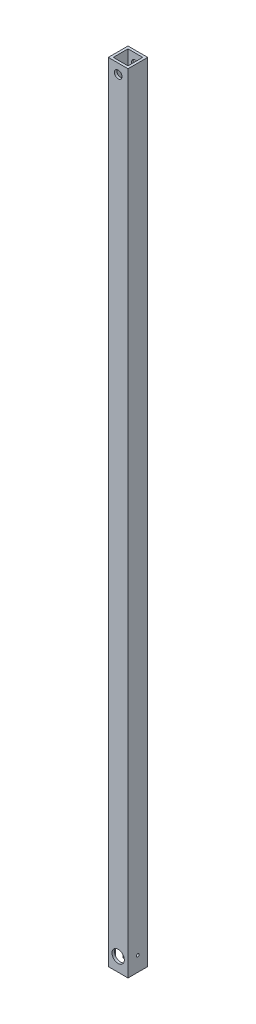
ISO-10303-21;
HEADER;
FILE_DESCRIPTION(('STEP AP214'),'2;1');
FILE_NAME('part.step','',(''),(''),'','','');
FILE_SCHEMA(('AUTOMOTIVE_DESIGN { 1 0 10303 214 1 1 1 1 }'));
ENDSEC;
DATA;
#1=APPLICATION_CONTEXT('core data for automotive mechanical design processes');
#2=APPLICATION_PROTOCOL_DEFINITION('international standard','automotive_design',2000,#1);
#3=PRODUCT_CONTEXT('',#1,'mechanical');
#4=PRODUCT('Part','Part','',(#3));
#5=PRODUCT_RELATED_PRODUCT_CATEGORY('part','',(#4));
#6=PRODUCT_DEFINITION_FORMATION('','',#4);
#7=PRODUCT_DEFINITION_CONTEXT('part definition',#1,'design');
#8=PRODUCT_DEFINITION('design','',#6,#7);
#9=PRODUCT_DEFINITION_SHAPE('','',#8);
#10=(LENGTH_UNIT() NAMED_UNIT(*) SI_UNIT(.MILLI.,.METRE.));
#11=(NAMED_UNIT(*) PLANE_ANGLE_UNIT() SI_UNIT($,.RADIAN.));
#12=(NAMED_UNIT(*) SI_UNIT($,.STERADIAN.) SOLID_ANGLE_UNIT());
#13=UNCERTAINTY_MEASURE_WITH_UNIT(LENGTH_MEASURE(1.E-05),#10,'distance_accuracy_value','');
#14=(GEOMETRIC_REPRESENTATION_CONTEXT(3) GLOBAL_UNCERTAINTY_ASSIGNED_CONTEXT((#13)) GLOBAL_UNIT_ASSIGNED_CONTEXT((#10,
#11,#12)) REPRESENTATION_CONTEXT('',''));
#15=CARTESIAN_POINT('',(0.,0.,0.));
#16=DIRECTION('',(0.,0.,1.));
#17=DIRECTION('',(1.,0.,0.));
#18=AXIS2_PLACEMENT_3D('',#15,#16,#17);
#19=CARTESIAN_POINT('',(0.,508.,0.));
#20=DIRECTION('',(0.,1.,0.));
#21=DIRECTION('',(0.,0.,1.));
#22=AXIS2_PLACEMENT_3D('',#19,#20,#21);
#23=PLANE('',#22);
#24=DIRECTION('',(0.,0.,-1.));
#25=VECTOR('',#24,1.);
#26=CARTESIAN_POINT('',(6.35,508.,-6.35));
#27=LINE('',#26,#25);
#28=CARTESIAN_POINT('',(6.35,508.,6.35));
#29=VERTEX_POINT('',#28);
#30=CARTESIAN_POINT('',(6.35,508.,-6.35));
#31=VERTEX_POINT('',#30);
#32=EDGE_CURVE('E237',#29,#31,#27,.T.);
#33=ORIENTED_EDGE('',*,*,#32,.T.);
#34=DIRECTION('',(-1.,0.,0.));
#35=VECTOR('',#34,1.);
#36=CARTESIAN_POINT('',(-6.35,508.,-6.35));
#37=LINE('',#36,#35);
#38=CARTESIAN_POINT('',(-6.35,508.,-6.35));
#39=VERTEX_POINT('',#38);
#40=EDGE_CURVE('E240',#31,#39,#37,.T.);
#41=ORIENTED_EDGE('',*,*,#40,.T.);
#42=DIRECTION('',(0.,0.,1.));
#43=VECTOR('',#42,1.);
#44=CARTESIAN_POINT('',(-6.35,508.,-6.35));
#45=LINE('',#44,#43);
#46=CARTESIAN_POINT('',(-6.35,508.,6.35));
#47=VERTEX_POINT('',#46);
#48=EDGE_CURVE('E243',#39,#47,#45,.T.);
#49=ORIENTED_EDGE('',*,*,#48,.T.);
#50=DIRECTION('',(1.,0.,0.));
#51=VECTOR('',#50,1.);
#52=CARTESIAN_POINT('',(-6.35,508.,6.35));
#53=LINE('',#52,#51);
#54=EDGE_CURVE('E245',#47,#29,#53,.T.);
#55=ORIENTED_EDGE('',*,*,#54,.T.);
#56=EDGE_LOOP('',(#33,#41,#49,#55));
#57=FACE_BOUND('',#56,.T.);
#58=DIRECTION('',(-1.,0.,0.));
#59=VECTOR('',#58,1.);
#60=CARTESIAN_POINT('',(-6.35,508.,-4.7625));
#61=LINE('',#60,#59);
#62=CARTESIAN_POINT('',(4.7625,508.,-4.7625));
#63=VERTEX_POINT('',#62);
#64=CARTESIAN_POINT('',(-4.7625,508.,-4.7625));
#65=VERTEX_POINT('',#64);
#66=EDGE_CURVE('E210',#63,#65,#61,.T.);
#67=ORIENTED_EDGE('',*,*,#66,.F.);
#68=DIRECTION('',(0.,0.,-1.));
#69=VECTOR('',#68,1.);
#70=CARTESIAN_POINT('',(4.7625,508.,-6.35));
#71=LINE('',#70,#69);
#72=CARTESIAN_POINT('',(4.7625,508.,4.7625));
#73=VERTEX_POINT('',#72);
#74=EDGE_CURVE('E208',#73,#63,#71,.T.);
#75=ORIENTED_EDGE('',*,*,#74,.F.);
#76=DIRECTION('',(1.,0.,0.));
#77=VECTOR('',#76,1.);
#78=CARTESIAN_POINT('',(-6.35,508.,4.7625));
#79=LINE('',#78,#77);
#80=CARTESIAN_POINT('',(-4.7625,508.,4.7625));
#81=VERTEX_POINT('',#80);
#82=EDGE_CURVE('E215',#81,#73,#79,.T.);
#83=ORIENTED_EDGE('',*,*,#82,.F.);
#84=DIRECTION('',(0.,0.,1.));
#85=VECTOR('',#84,1.);
#86=CARTESIAN_POINT('',(-4.7625,508.,-6.35));
#87=LINE('',#86,#85);
#88=EDGE_CURVE('E213',#65,#81,#87,.T.);
#89=ORIENTED_EDGE('',*,*,#88,.F.);
#90=EDGE_LOOP('',(#67,#75,#83,#89));
#91=FACE_BOUND('',#90,.T.);
#92=ADVANCED_FACE('F61',(#57,#91),#23,.T.);
#93=CARTESIAN_POINT('',(0.,0.,0.));
#94=DIRECTION('',(0.,1.,0.));
#95=DIRECTION('',(0.,0.,1.));
#96=AXIS2_PLACEMENT_3D('',#93,#94,#95);
#97=PLANE('',#96);
#98=DIRECTION('',(0.,0.,1.));
#99=VECTOR('',#98,1.);
#100=CARTESIAN_POINT('',(-6.35,0.,-6.35));
#101=LINE('',#100,#99);
#102=CARTESIAN_POINT('',(-6.35,0.,3.175));
#103=VERTEX_POINT('',#102);
#104=CARTESIAN_POINT('',(-6.35,0.,6.35));
#105=VERTEX_POINT('',#104);
#106=EDGE_CURVE('E252',#103,#105,#101,.T.);
#107=ORIENTED_EDGE('',*,*,#106,.F.);
#108=DIRECTION('',(-1.,0.,0.));
#109=VECTOR('',#108,1.);
#110=CARTESIAN_POINT('',(6.351,0.,3.175));
#111=LINE('',#110,#109);
#112=CARTESIAN_POINT('',(-4.7625,0.,3.175));
#113=VERTEX_POINT('',#112);
#114=EDGE_CURVE('E170',#113,#103,#111,.T.);
#115=ORIENTED_EDGE('',*,*,#114,.F.);
#116=DIRECTION('',(0.,0.,1.));
#117=VECTOR('',#116,1.);
#118=CARTESIAN_POINT('',(-4.7625,0.,-6.35));
#119=LINE('',#118,#117);
#120=CARTESIAN_POINT('',(-4.7625,0.,4.7625));
#121=VERTEX_POINT('',#120);
#122=EDGE_CURVE('E174',#113,#121,#119,.T.);
#123=ORIENTED_EDGE('',*,*,#122,.T.);
#124=DIRECTION('',(1.,0.,0.));
#125=VECTOR('',#124,1.);
#126=CARTESIAN_POINT('',(-6.35,0.,4.7625));
#127=LINE('',#126,#125);
#128=CARTESIAN_POINT('',(4.7625,0.,4.7625));
#129=VERTEX_POINT('',#128);
#130=EDGE_CURVE('E211',#121,#129,#127,.T.);
#131=ORIENTED_EDGE('',*,*,#130,.T.);
#132=DIRECTION('',(0.,0.,-1.));
#133=VECTOR('',#132,1.);
#134=CARTESIAN_POINT('',(4.7625,0.,-6.35));
#135=LINE('',#134,#133);
#136=CARTESIAN_POINT('',(4.7625,0.,-4.7625));
#137=VERTEX_POINT('',#136);
#138=EDGE_CURVE('E207',#129,#137,#135,.T.);
#139=ORIENTED_EDGE('',*,*,#138,.T.);
#140=DIRECTION('',(-1.,0.,0.));
#141=VECTOR('',#140,1.);
#142=CARTESIAN_POINT('',(-6.35,0.,-4.7625));
#143=LINE('',#142,#141);
#144=CARTESIAN_POINT('',(-4.7625,0.,-4.7625));
#145=VERTEX_POINT('',#144);
#146=EDGE_CURVE('E220',#137,#145,#143,.T.);
#147=ORIENTED_EDGE('',*,*,#146,.T.);
#148=CARTESIAN_POINT('',(-4.7625,0.,-3.175));
#149=VERTEX_POINT('',#148);
#150=EDGE_CURVE('E223',#145,#149,#119,.T.);
#151=ORIENTED_EDGE('',*,*,#150,.T.);
#152=DIRECTION('',(-1.,0.,0.));
#153=VECTOR('',#152,1.);
#154=CARTESIAN_POINT('',(6.351,0.,-3.175));
#155=LINE('',#154,#153);
#156=CARTESIAN_POINT('',(-6.35,0.,-3.175));
#157=VERTEX_POINT('',#156);
#158=EDGE_CURVE('E77',#149,#157,#155,.T.);
#159=ORIENTED_EDGE('',*,*,#158,.T.);
#160=CARTESIAN_POINT('',(-6.35,0.,-6.35));
#161=VERTEX_POINT('',#160);
#162=EDGE_CURVE('E253',#161,#157,#101,.T.);
#163=ORIENTED_EDGE('',*,*,#162,.F.);
#164=DIRECTION('',(-1.,0.,0.));
#165=VECTOR('',#164,1.);
#166=CARTESIAN_POINT('',(-6.35,0.,-6.35));
#167=LINE('',#166,#165);
#168=CARTESIAN_POINT('',(6.35,0.,-6.35));
#169=VERTEX_POINT('',#168);
#170=EDGE_CURVE('E250',#169,#161,#167,.T.);
#171=ORIENTED_EDGE('',*,*,#170,.F.);
#172=DIRECTION('',(0.,0.,-1.));
#173=VECTOR('',#172,1.);
#174=CARTESIAN_POINT('',(6.35,0.,-6.35));
#175=LINE('',#174,#173);
#176=CARTESIAN_POINT('',(6.35,0.,6.35));
#177=VERTEX_POINT('',#176);
#178=EDGE_CURVE('E236',#177,#169,#175,.T.);
#179=ORIENTED_EDGE('',*,*,#178,.F.);
#180=DIRECTION('',(1.,0.,0.));
#181=VECTOR('',#180,1.);
#182=CARTESIAN_POINT('',(-6.35,0.,6.35));
#183=LINE('',#182,#181);
#184=EDGE_CURVE('E241',#105,#177,#183,.T.);
#185=ORIENTED_EDGE('',*,*,#184,.F.);
#186=EDGE_LOOP('',(#107,#115,#123,#131,#139,#147,#151,#159,#163,#171,#179,#185));
#187=FACE_BOUND('',#186,.T.);
#188=ADVANCED_FACE('F273',(#187),#97,.F.);
#189=CARTESIAN_POINT('',(6.35,508.,-6.35));
#190=DIRECTION('',(-1.,0.,0.));
#191=DIRECTION('',(0.,0.,1.));
#192=AXIS2_PLACEMENT_3D('',#189,#190,#191);
#193=PLANE('',#192);
#194=CARTESIAN_POINT('',(6.35,9.525,0.));
#195=DIRECTION('',(1.,0.,0.));
#196=DIRECTION('',(0.,0.,-1.));
#197=AXIS2_PLACEMENT_3D('',#194,#195,#196);
#198=CIRCLE('',#197,0.889);
#199=CARTESIAN_POINT('',(6.35,9.525,-0.889));
#200=VERTEX_POINT('',#199);
#201=EDGE_CURVE('E189',#200,#200,#198,.T.);
#202=ORIENTED_EDGE('',*,*,#201,.F.);
#203=EDGE_LOOP('',(#202));
#204=FACE_BOUND('',#203,.T.);
#205=ORIENTED_EDGE('',*,*,#178,.T.);
#206=DIRECTION('',(0.,-1.,0.));
#207=VECTOR('',#206,1.);
#208=CARTESIAN_POINT('',(6.35,508.,-6.35));
#209=LINE('',#208,#207);
#210=EDGE_CURVE('E12',#31,#169,#209,.T.);
#211=ORIENTED_EDGE('',*,*,#210,.F.);
#212=ORIENTED_EDGE('',*,*,#32,.F.);
#213=DIRECTION('',(0.,-1.,0.));
#214=VECTOR('',#213,1.);
#215=CARTESIAN_POINT('',(6.35,508.,6.35));
#216=LINE('',#215,#214);
#217=EDGE_CURVE('E247',#29,#177,#216,.T.);
#218=ORIENTED_EDGE('',*,*,#217,.T.);
#219=EDGE_LOOP('',(#205,#211,#212,#218));
#220=FACE_BOUND('',#219,.T.);
#221=ADVANCED_FACE('F63',(#204,#220),#193,.F.);
#222=CARTESIAN_POINT('',(-6.35,508.,-6.35));
#223=DIRECTION('',(0.,0.,1.));
#224=DIRECTION('',(1.,0.,0.));
#225=AXIS2_PLACEMENT_3D('',#222,#223,#224);
#226=PLANE('',#225);
#227=CARTESIAN_POINT('',(0.,501.65,-6.35));
#228=DIRECTION('',(0.,0.,1.));
#229=DIRECTION('',(1.,0.,0.));
#230=AXIS2_PLACEMENT_3D('',#227,#228,#229);
#231=CIRCLE('',#230,2.47649999999998);
#232=CARTESIAN_POINT('',(2.47649999999998,501.65,-6.35));
#233=VERTEX_POINT('',#232);
#234=EDGE_CURVE('E192',#233,#233,#231,.T.);
#235=ORIENTED_EDGE('',*,*,#234,.T.);
#236=EDGE_LOOP('',(#235));
#237=FACE_BOUND('',#236,.T.);
#238=ORIENTED_EDGE('',*,*,#170,.T.);
#239=DIRECTION('',(0.,-1.,0.));
#240=VECTOR('',#239,1.);
#241=CARTESIAN_POINT('',(-6.35,508.,-6.35));
#242=LINE('',#241,#240);
#243=EDGE_CURVE('E70',#39,#161,#242,.T.);
#244=ORIENTED_EDGE('',*,*,#243,.F.);
#245=ORIENTED_EDGE('',*,*,#40,.F.);
#246=ORIENTED_EDGE('',*,*,#210,.T.);
#247=EDGE_LOOP('',(#238,#244,#245,#246));
#248=FACE_BOUND('',#247,.T.);
#249=ADVANCED_FACE('F289',(#237,#248),#226,.F.);
#250=CARTESIAN_POINT('',(-6.35,508.,-6.35));
#251=DIRECTION('',(1.,0.,0.));
#252=DIRECTION('',(0.,0.,-1.));
#253=AXIS2_PLACEMENT_3D('',#250,#251,#252);
#254=PLANE('',#253);
#255=DIRECTION('',(0.,0.,-1.));
#256=VECTOR('',#255,1.);
#257=CARTESIAN_POINT('',(-6.35,9.525,-3.175));
#258=LINE('',#257,#256);
#259=CARTESIAN_POINT('',(-6.35,9.525,3.175));
#260=VERTEX_POINT('',#259);
#261=CARTESIAN_POINT('',(-6.35,9.525,-3.175));
#262=VERTEX_POINT('',#261);
#263=EDGE_CURVE('E181',#260,#262,#258,.T.);
#264=ORIENTED_EDGE('',*,*,#263,.F.);
#265=DIRECTION('',(0.,1.,0.));
#266=VECTOR('',#265,1.);
#267=CARTESIAN_POINT('',(-6.35,0.,3.175));
#268=LINE('',#267,#266);
#269=EDGE_CURVE('E168',#103,#260,#268,.T.);
#270=ORIENTED_EDGE('',*,*,#269,.F.);
#271=ORIENTED_EDGE('',*,*,#106,.T.);
#272=DIRECTION('',(0.,-1.,0.));
#273=VECTOR('',#272,1.);
#274=CARTESIAN_POINT('',(-6.35,508.,6.35));
#275=LINE('',#274,#273);
#276=EDGE_CURVE('E259',#47,#105,#275,.T.);
#277=ORIENTED_EDGE('',*,*,#276,.F.);
#278=ORIENTED_EDGE('',*,*,#48,.F.);
#279=ORIENTED_EDGE('',*,*,#243,.T.);
#280=ORIENTED_EDGE('',*,*,#162,.T.);
#281=DIRECTION('',(0.,-1.,0.));
#282=VECTOR('',#281,1.);
#283=CARTESIAN_POINT('',(-6.35,0.,-3.175));
#284=LINE('',#283,#282);
#285=EDGE_CURVE('E178',#262,#157,#284,.T.);
#286=ORIENTED_EDGE('',*,*,#285,.F.);
#287=EDGE_LOOP('',(#264,#270,#271,#277,#278,#279,#280,#286));
#288=FACE_BOUND('',#287,.T.);
#289=ADVANCED_FACE('F267',(#288),#254,.F.);
#290=CARTESIAN_POINT('',(-6.35,508.,6.35));
#291=DIRECTION('',(0.,0.,-1.));
#292=DIRECTION('',(-1.,0.,0.));
#293=AXIS2_PLACEMENT_3D('',#290,#291,#292);
#294=PLANE('',#293);
#295=CARTESIAN_POINT('',(0.,501.65,6.35));
#296=DIRECTION('',(0.,0.,-1.));
#297=DIRECTION('',(-1.,0.,0.));
#298=AXIS2_PLACEMENT_3D('',#295,#296,#297);
#299=CIRCLE('',#298,2.47649999999998);
#300=CARTESIAN_POINT('',(-2.47649999999998,501.65,6.35));
#301=VERTEX_POINT('',#300);
#302=EDGE_CURVE('E198',#301,#301,#299,.T.);
#303=ORIENTED_EDGE('',*,*,#302,.T.);
#304=EDGE_LOOP('',(#303));
#305=FACE_BOUND('',#304,.T.);
#306=CARTESIAN_POINT('',(0.,8.91230119999997,6.35));
#307=DIRECTION('',(0.,0.,1.));
#308=DIRECTION('',(1.,0.,0.));
#309=AXIS2_PLACEMENT_3D('',#306,#307,#308);
#310=CIRCLE('',#309,3.96875000000002);
#311=CARTESIAN_POINT('',(3.96875000000003,8.91230119999997,6.35));
#312=VERTEX_POINT('',#311);
#313=EDGE_CURVE('E201',#312,#312,#310,.T.);
#314=ORIENTED_EDGE('',*,*,#313,.F.);
#315=EDGE_LOOP('',(#314));
#316=FACE_BOUND('',#315,.T.);
#317=ORIENTED_EDGE('',*,*,#184,.T.);
#318=ORIENTED_EDGE('',*,*,#217,.F.);
#319=ORIENTED_EDGE('',*,*,#54,.F.);
#320=ORIENTED_EDGE('',*,*,#276,.T.);
#321=EDGE_LOOP('',(#317,#318,#319,#320));
#322=FACE_BOUND('',#321,.T.);
#323=ADVANCED_FACE('F282',(#305,#316,#322),#294,.F.);
#324=CARTESIAN_POINT('',(4.7625,508.,-6.35));
#325=DIRECTION('',(-1.,0.,0.));
#326=DIRECTION('',(0.,0.,1.));
#327=AXIS2_PLACEMENT_3D('',#324,#325,#326);
#328=PLANE('',#327);
#329=CARTESIAN_POINT('',(4.7625,9.525,0.));
#330=DIRECTION('',(-1.,0.,0.));
#331=DIRECTION('',(0.,0.,1.));
#332=AXIS2_PLACEMENT_3D('',#329,#330,#331);
#333=CIRCLE('',#332,0.889);
#334=CARTESIAN_POINT('',(4.7625,9.525,0.888999999999999));
#335=VERTEX_POINT('',#334);
#336=EDGE_CURVE('E183',#335,#335,#333,.F.);
#337=ORIENTED_EDGE('',*,*,#336,.T.);
#338=EDGE_LOOP('',(#337));
#339=FACE_BOUND('',#338,.T.);
#340=ORIENTED_EDGE('',*,*,#138,.F.);
#341=DIRECTION('',(0.,-1.,0.));
#342=VECTOR('',#341,1.);
#343=CARTESIAN_POINT('',(4.7625,508.,4.7625));
#344=LINE('',#343,#342);
#345=EDGE_CURVE('E217',#73,#129,#344,.T.);
#346=ORIENTED_EDGE('',*,*,#345,.F.);
#347=ORIENTED_EDGE('',*,*,#74,.T.);
#348=DIRECTION('',(0.,-1.,0.));
#349=VECTOR('',#348,1.);
#350=CARTESIAN_POINT('',(4.7625,508.,-4.7625));
#351=LINE('',#350,#349);
#352=EDGE_CURVE('E233',#63,#137,#351,.T.);
#353=ORIENTED_EDGE('',*,*,#352,.T.);
#354=EDGE_LOOP('',(#340,#346,#347,#353));
#355=FACE_BOUND('',#354,.T.);
#356=ADVANCED_FACE('F308',(#339,#355),#328,.T.);
#357=CARTESIAN_POINT('',(-6.35,508.,-4.7625));
#358=DIRECTION('',(0.,0.,1.));
#359=DIRECTION('',(1.,0.,0.));
#360=AXIS2_PLACEMENT_3D('',#357,#358,#359);
#361=PLANE('',#360);
#362=CARTESIAN_POINT('',(0.,501.65,-4.7625));
#363=DIRECTION('',(0.,0.,1.));
#364=DIRECTION('',(1.,0.,0.));
#365=AXIS2_PLACEMENT_3D('',#362,#363,#364);
#366=CIRCLE('',#365,2.47649999999998);
#367=CARTESIAN_POINT('',(2.47649999999998,501.65,-4.7625));
#368=VERTEX_POINT('',#367);
#369=EDGE_CURVE('E195',#368,#368,#366,.T.);
#370=ORIENTED_EDGE('',*,*,#369,.F.);
#371=EDGE_LOOP('',(#370));
#372=FACE_BOUND('',#371,.T.);
#373=ORIENTED_EDGE('',*,*,#146,.F.);
#374=ORIENTED_EDGE('',*,*,#352,.F.);
#375=ORIENTED_EDGE('',*,*,#66,.T.);
#376=DIRECTION('',(0.,-1.,0.));
#377=VECTOR('',#376,1.);
#378=CARTESIAN_POINT('',(-4.7625,508.,-4.7625));
#379=LINE('',#378,#377);
#380=EDGE_CURVE('E231',#65,#145,#379,.T.);
#381=ORIENTED_EDGE('',*,*,#380,.T.);
#382=EDGE_LOOP('',(#373,#374,#375,#381));
#383=FACE_BOUND('',#382,.T.);
#384=ADVANCED_FACE('F316',(#372,#383),#361,.T.);
#385=CARTESIAN_POINT('',(-4.7625,508.,-6.35));
#386=DIRECTION('',(1.,0.,0.));
#387=DIRECTION('',(0.,0.,-1.));
#388=AXIS2_PLACEMENT_3D('',#385,#386,#387);
#389=PLANE('',#388);
#390=DIRECTION('',(0.,1.,0.));
#391=VECTOR('',#390,1.);
#392=CARTESIAN_POINT('',(-4.7625,0.,3.175));
#393=LINE('',#392,#391);
#394=CARTESIAN_POINT('',(-4.7625,9.525,3.175));
#395=VERTEX_POINT('',#394);
#396=EDGE_CURVE('E162',#113,#395,#393,.T.);
#397=ORIENTED_EDGE('',*,*,#396,.T.);
#398=DIRECTION('',(0.,0.,-1.));
#399=VECTOR('',#398,1.);
#400=CARTESIAN_POINT('',(-4.7625,9.525,-3.175));
#401=LINE('',#400,#399);
#402=CARTESIAN_POINT('',(-4.7625,9.525,-3.175));
#403=VERTEX_POINT('',#402);
#404=EDGE_CURVE('E152',#395,#403,#401,.T.);
#405=ORIENTED_EDGE('',*,*,#404,.T.);
#406=DIRECTION('',(0.,-1.,0.));
#407=VECTOR('',#406,1.);
#408=CARTESIAN_POINT('',(-4.7625,0.,-3.175));
#409=LINE('',#408,#407);
#410=EDGE_CURVE('E161',#403,#149,#409,.T.);
#411=ORIENTED_EDGE('',*,*,#410,.T.);
#412=ORIENTED_EDGE('',*,*,#150,.F.);
#413=ORIENTED_EDGE('',*,*,#380,.F.);
#414=ORIENTED_EDGE('',*,*,#88,.T.);
#415=DIRECTION('',(0.,-1.,0.));
#416=VECTOR('',#415,1.);
#417=CARTESIAN_POINT('',(-4.7625,508.,4.7625));
#418=LINE('',#417,#416);
#419=EDGE_CURVE('E85',#81,#121,#418,.T.);
#420=ORIENTED_EDGE('',*,*,#419,.T.);
#421=ORIENTED_EDGE('',*,*,#122,.F.);
#422=EDGE_LOOP('',(#397,#405,#411,#412,#413,#414,#420,#421));
#423=FACE_BOUND('',#422,.T.);
#424=ADVANCED_FACE('F173',(#423),#389,.T.);
#425=CARTESIAN_POINT('',(-6.35,508.,4.7625));
#426=DIRECTION('',(0.,0.,-1.));
#427=DIRECTION('',(-1.,0.,0.));
#428=AXIS2_PLACEMENT_3D('',#425,#426,#427);
#429=PLANE('',#428);
#430=CARTESIAN_POINT('',(0.,501.65,4.7625));
#431=DIRECTION('',(0.,0.,-1.));
#432=DIRECTION('',(-1.,0.,0.));
#433=AXIS2_PLACEMENT_3D('',#430,#431,#432);
#434=CIRCLE('',#433,2.47649999999998);
#435=CARTESIAN_POINT('',(-2.47649999999998,501.65,4.7625));
#436=VERTEX_POINT('',#435);
#437=EDGE_CURVE('E65',#436,#436,#434,.T.);
#438=ORIENTED_EDGE('',*,*,#437,.F.);
#439=EDGE_LOOP('',(#438));
#440=FACE_BOUND('',#439,.T.);
#441=CARTESIAN_POINT('',(0.,8.91230119999997,4.7625));
#442=DIRECTION('',(0.,0.,-1.));
#443=DIRECTION('',(-1.,0.,0.));
#444=AXIS2_PLACEMENT_3D('',#441,#442,#443);
#445=CIRCLE('',#444,3.96875000000002);
#446=CARTESIAN_POINT('',(-3.96875000000001,8.91230119999997,4.7625));
#447=VERTEX_POINT('',#446);
#448=EDGE_CURVE('E204',#447,#447,#445,.F.);
#449=ORIENTED_EDGE('',*,*,#448,.T.);
#450=EDGE_LOOP('',(#449));
#451=FACE_BOUND('',#450,.T.);
#452=ORIENTED_EDGE('',*,*,#130,.F.);
#453=ORIENTED_EDGE('',*,*,#419,.F.);
#454=ORIENTED_EDGE('',*,*,#82,.T.);
#455=ORIENTED_EDGE('',*,*,#345,.T.);
#456=EDGE_LOOP('',(#452,#453,#454,#455));
#457=FACE_BOUND('',#456,.T.);
#458=ADVANCED_FACE('F326',(#440,#451,#457),#429,.T.);
#459=CARTESIAN_POINT('',(0.,8.91230119999997,-6.4628201513365));
#460=DIRECTION('',(0.,0.,1.));
#461=DIRECTION('',(1.,0.,0.));
#462=AXIS2_PLACEMENT_3D('',#459,#460,#461);
#463=CYLINDRICAL_SURFACE('',#462,3.96875000000002);
#464=ORIENTED_EDGE('',*,*,#313,.T.);
#465=EDGE_LOOP('',(#464));
#466=FACE_BOUND('',#465,.T.);
#467=ORIENTED_EDGE('',*,*,#448,.F.);
#468=EDGE_LOOP('',(#467));
#469=FACE_BOUND('',#468,.T.);
#470=ADVANCED_FACE('F322',(#466,#469),#463,.F.);
#471=CARTESIAN_POINT('',(0.,501.65,-6.35));
#472=DIRECTION('',(0.,0.,1.));
#473=DIRECTION('',(1.,0.,0.));
#474=AXIS2_PLACEMENT_3D('',#471,#472,#473);
#475=CYLINDRICAL_SURFACE('',#474,2.47649999999998);
#476=ORIENTED_EDGE('',*,*,#437,.T.);
#477=EDGE_LOOP('',(#476));
#478=FACE_BOUND('',#477,.T.);
#479=ORIENTED_EDGE('',*,*,#302,.F.);
#480=EDGE_LOOP('',(#479));
#481=FACE_BOUND('',#480,.T.);
#482=ADVANCED_FACE('F325',(#478,#481),#475,.F.);
#483=ORIENTED_EDGE('',*,*,#369,.T.);
#484=EDGE_LOOP('',(#483));
#485=FACE_BOUND('',#484,.T.);
#486=ORIENTED_EDGE('',*,*,#234,.F.);
#487=EDGE_LOOP('',(#486));
#488=FACE_BOUND('',#487,.T.);
#489=ADVANCED_FACE('F349',(#485,#488),#475,.F.);
#490=CARTESIAN_POINT('',(-6.351,9.525,0.));
#491=DIRECTION('',(1.,0.,0.));
#492=DIRECTION('',(0.,0.,-1.));
#493=AXIS2_PLACEMENT_3D('',#490,#491,#492);
#494=CYLINDRICAL_SURFACE('',#493,0.889);
#495=ORIENTED_EDGE('',*,*,#336,.F.);
#496=EDGE_LOOP('',(#495));
#497=FACE_BOUND('',#496,.T.);
#498=ORIENTED_EDGE('',*,*,#201,.T.);
#499=EDGE_LOOP('',(#498));
#500=FACE_BOUND('',#499,.T.);
#501=ADVANCED_FACE('F351',(#497,#500),#494,.F.);
#502=CARTESIAN_POINT('',(6.351,0.,3.175));
#503=DIRECTION('',(0.,0.,1.));
#504=DIRECTION('',(1.,0.,0.));
#505=AXIS2_PLACEMENT_3D('',#502,#503,#504);
#506=PLANE('',#505);
#507=ORIENTED_EDGE('',*,*,#114,.T.);
#508=ORIENTED_EDGE('',*,*,#269,.T.);
#509=DIRECTION('',(-1.,0.,0.));
#510=VECTOR('',#509,1.);
#511=CARTESIAN_POINT('',(6.351,9.525,3.175));
#512=LINE('',#511,#510);
#513=EDGE_CURVE('E156',#395,#260,#512,.T.);
#514=ORIENTED_EDGE('',*,*,#513,.F.);
#515=ORIENTED_EDGE('',*,*,#396,.F.);
#516=EDGE_LOOP('',(#507,#508,#514,#515));
#517=FACE_BOUND('',#516,.T.);
#518=ADVANCED_FACE('F165',(#517),#506,.F.);
#519=CARTESIAN_POINT('',(6.351,9.525,-3.175));
#520=DIRECTION('',(0.,1.,0.));
#521=DIRECTION('',(0.,0.,1.));
#522=AXIS2_PLACEMENT_3D('',#519,#520,#521);
#523=PLANE('',#522);
#524=ORIENTED_EDGE('',*,*,#513,.T.);
#525=ORIENTED_EDGE('',*,*,#263,.T.);
#526=DIRECTION('',(-1.,0.,0.));
#527=VECTOR('',#526,1.);
#528=CARTESIAN_POINT('',(6.351,9.525,-3.175));
#529=LINE('',#528,#527);
#530=EDGE_CURVE('E158',#403,#262,#529,.T.);
#531=ORIENTED_EDGE('',*,*,#530,.F.);
#532=ORIENTED_EDGE('',*,*,#404,.F.);
#533=EDGE_LOOP('',(#524,#525,#531,#532));
#534=FACE_BOUND('',#533,.T.);
#535=ADVANCED_FACE('F154',(#534),#523,.F.);
#536=CARTESIAN_POINT('',(6.351,0.,-3.175));
#537=DIRECTION('',(0.,0.,-1.));
#538=DIRECTION('',(-1.,0.,0.));
#539=AXIS2_PLACEMENT_3D('',#536,#537,#538);
#540=PLANE('',#539);
#541=ORIENTED_EDGE('',*,*,#530,.T.);
#542=ORIENTED_EDGE('',*,*,#285,.T.);
#543=ORIENTED_EDGE('',*,*,#158,.F.);
#544=ORIENTED_EDGE('',*,*,#410,.F.);
#545=EDGE_LOOP('',(#541,#542,#543,#544));
#546=FACE_BOUND('',#545,.T.);
#547=ADVANCED_FACE('F278',(#546),#540,.F.);
#548=CLOSED_SHELL('',(#92,#188,#221,#249,#289,#323,#356,#384,#424,#458,#470,#482,#489,#501,#518,
#535,#547));
#549=MANIFOLD_SOLID_BREP('B2',#548);
#550=ADVANCED_BREP_SHAPE_REPRESENTATION('',(#18,#549),#14);
#551=SHAPE_DEFINITION_REPRESENTATION(#9,#550);
ENDSEC;
END-ISO-10303-21;
